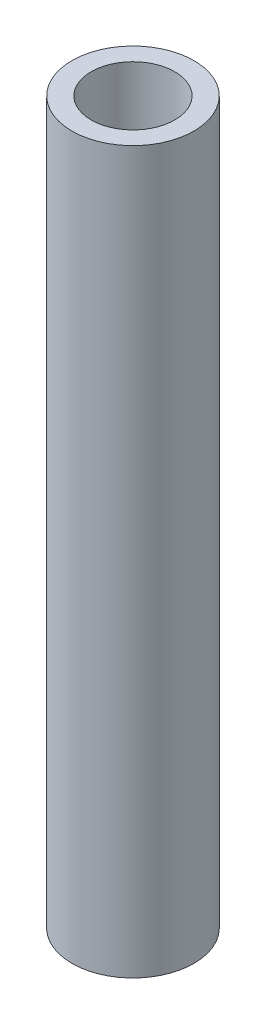
ISO-10303-21;
HEADER;
FILE_DESCRIPTION(('STEP AP214'),'2;1');
FILE_NAME('part.step','',(''),(''),'','','');
FILE_SCHEMA(('AUTOMOTIVE_DESIGN { 1 0 10303 214 1 1 1 1 }'));
ENDSEC;
DATA;
#1=APPLICATION_CONTEXT('core data for automotive mechanical design processes');
#2=APPLICATION_PROTOCOL_DEFINITION('international standard','automotive_design',2000,#1);
#3=PRODUCT_CONTEXT('',#1,'mechanical');
#4=PRODUCT('Part','Part','',(#3));
#5=PRODUCT_RELATED_PRODUCT_CATEGORY('part','',(#4));
#6=PRODUCT_DEFINITION_FORMATION('','',#4);
#7=PRODUCT_DEFINITION_CONTEXT('part definition',#1,'design');
#8=PRODUCT_DEFINITION('design','',#6,#7);
#9=PRODUCT_DEFINITION_SHAPE('','',#8);
#10=(LENGTH_UNIT() NAMED_UNIT(*) SI_UNIT(.MILLI.,.METRE.));
#11=(NAMED_UNIT(*) PLANE_ANGLE_UNIT() SI_UNIT($,.RADIAN.));
#12=(NAMED_UNIT(*) SI_UNIT($,.STERADIAN.) SOLID_ANGLE_UNIT());
#13=UNCERTAINTY_MEASURE_WITH_UNIT(LENGTH_MEASURE(1.E-05),#10,'distance_accuracy_value','');
#14=(GEOMETRIC_REPRESENTATION_CONTEXT(3) GLOBAL_UNCERTAINTY_ASSIGNED_CONTEXT((#13)) GLOBAL_UNIT_ASSIGNED_CONTEXT((#10,
#11,#12)) REPRESENTATION_CONTEXT('',''));
#15=CARTESIAN_POINT('',(0.,0.,0.));
#16=DIRECTION('',(0.,0.,1.));
#17=DIRECTION('',(1.,0.,0.));
#18=AXIS2_PLACEMENT_3D('',#15,#16,#17);
#19=CARTESIAN_POINT('',(0.,150.,0.));
#20=DIRECTION('',(0.,1.,0.));
#21=DIRECTION('',(0.,0.,1.));
#22=AXIS2_PLACEMENT_3D('',#19,#20,#21);
#23=PLANE('',#22);
#24=CARTESIAN_POINT('',(0.,150.,0.));
#25=DIRECTION('',(0.,1.,0.));
#26=DIRECTION('',(0.,0.,1.));
#27=AXIS2_PLACEMENT_3D('',#24,#25,#26);
#28=CIRCLE('',#27,12.7);
#29=CARTESIAN_POINT('',(0.,150.,12.7));
#30=VERTEX_POINT('',#29);
#31=EDGE_CURVE('E10',#30,#30,#28,.T.);
#32=ORIENTED_EDGE('',*,*,#31,.T.);
#33=EDGE_LOOP('',(#32));
#34=FACE_BOUND('',#33,.T.);
#35=CARTESIAN_POINT('',(0.,150.,0.));
#36=DIRECTION('',(0.,1.,0.));
#37=DIRECTION('',(0.,0.,1.));
#38=AXIS2_PLACEMENT_3D('',#35,#36,#37);
#39=CIRCLE('',#38,8.7);
#40=CARTESIAN_POINT('',(0.,150.,8.7));
#41=VERTEX_POINT('',#40);
#42=EDGE_CURVE('E42',#41,#41,#39,.T.);
#43=ORIENTED_EDGE('',*,*,#42,.F.);
#44=EDGE_LOOP('',(#43));
#45=FACE_BOUND('',#44,.T.);
#46=ADVANCED_FACE('F31',(#34,#45),#23,.T.);
#47=CARTESIAN_POINT('',(0.,0.,0.));
#48=DIRECTION('',(0.,1.,0.));
#49=DIRECTION('',(0.,0.,1.));
#50=AXIS2_PLACEMENT_3D('',#47,#48,#49);
#51=PLANE('',#50);
#52=CARTESIAN_POINT('',(0.,0.,0.));
#53=DIRECTION('',(0.,1.,0.));
#54=DIRECTION('',(0.,0.,1.));
#55=AXIS2_PLACEMENT_3D('',#52,#53,#54);
#56=CIRCLE('',#55,12.7);
#57=CARTESIAN_POINT('',(0.,0.,12.7));
#58=VERTEX_POINT('',#57);
#59=EDGE_CURVE('E35',#58,#58,#56,.T.);
#60=ORIENTED_EDGE('',*,*,#59,.F.);
#61=EDGE_LOOP('',(#60));
#62=FACE_BOUND('',#61,.T.);
#63=CARTESIAN_POINT('',(0.,0.,0.));
#64=DIRECTION('',(0.,1.,0.));
#65=DIRECTION('',(0.,0.,1.));
#66=AXIS2_PLACEMENT_3D('',#63,#64,#65);
#67=CIRCLE('',#66,8.7);
#68=CARTESIAN_POINT('',(0.,0.,8.7));
#69=VERTEX_POINT('',#68);
#70=EDGE_CURVE('E44',#69,#69,#67,.T.);
#71=ORIENTED_EDGE('',*,*,#70,.T.);
#72=EDGE_LOOP('',(#71));
#73=FACE_BOUND('',#72,.T.);
#74=ADVANCED_FACE('F54',(#62,#73),#51,.F.);
#75=CARTESIAN_POINT('',(0.,150.,0.));
#76=DIRECTION('',(0.,-1.,0.));
#77=DIRECTION('',(0.,0.,-1.));
#78=AXIS2_PLACEMENT_3D('',#75,#76,#77);
#79=CYLINDRICAL_SURFACE('',#78,12.7);
#80=ORIENTED_EDGE('',*,*,#31,.F.);
#81=EDGE_LOOP('',(#80));
#82=FACE_BOUND('',#81,.T.);
#83=ORIENTED_EDGE('',*,*,#59,.T.);
#84=EDGE_LOOP('',(#83));
#85=FACE_BOUND('',#84,.T.);
#86=ADVANCED_FACE('F33',(#82,#85),#79,.T.);
#87=CARTESIAN_POINT('',(0.,150.,0.));
#88=DIRECTION('',(0.,-1.,0.));
#89=DIRECTION('',(0.,0.,-1.));
#90=AXIS2_PLACEMENT_3D('',#87,#88,#89);
#91=CYLINDRICAL_SURFACE('',#90,8.7);
#92=ORIENTED_EDGE('',*,*,#42,.T.);
#93=EDGE_LOOP('',(#92));
#94=FACE_BOUND('',#93,.T.);
#95=ORIENTED_EDGE('',*,*,#70,.F.);
#96=EDGE_LOOP('',(#95));
#97=FACE_BOUND('',#96,.T.);
#98=ADVANCED_FACE('F50',(#94,#97),#91,.F.);
#99=CLOSED_SHELL('',(#46,#74,#86,#98));
#100=MANIFOLD_SOLID_BREP('B2',#99);
#101=ADVANCED_BREP_SHAPE_REPRESENTATION('',(#18,#100),#14);
#102=SHAPE_DEFINITION_REPRESENTATION(#9,#101);
ENDSEC;
END-ISO-10303-21;
